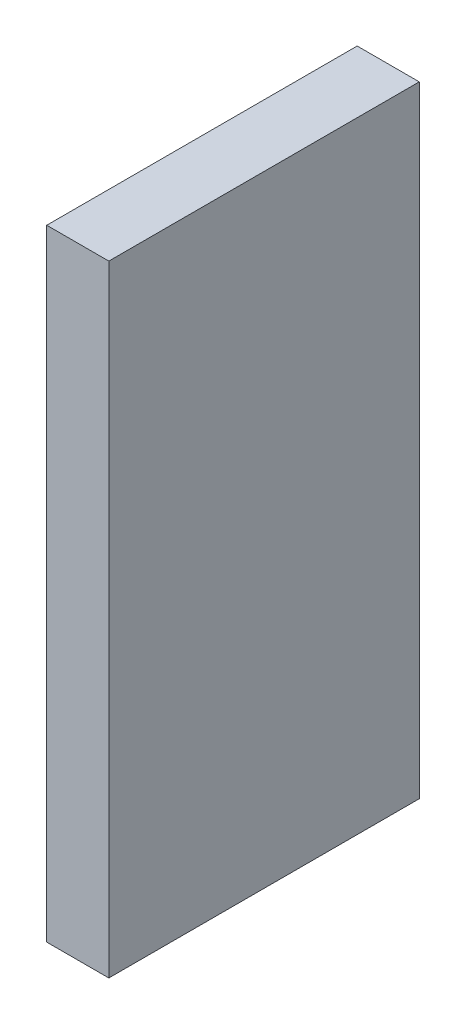
ISO-10303-21;
HEADER;
FILE_DESCRIPTION(('STEP AP214'),'2;1');
FILE_NAME('part.step','',(''),(''),'','','');
FILE_SCHEMA(('AUTOMOTIVE_DESIGN { 1 0 10303 214 1 1 1 1 }'));
ENDSEC;
DATA;
#1=APPLICATION_CONTEXT('core data for automotive mechanical design processes');
#2=APPLICATION_PROTOCOL_DEFINITION('international standard','automotive_design',2000,#1);
#3=PRODUCT_CONTEXT('',#1,'mechanical');
#4=PRODUCT('Part','Part','',(#3));
#5=PRODUCT_RELATED_PRODUCT_CATEGORY('part','',(#4));
#6=PRODUCT_DEFINITION_FORMATION('','',#4);
#7=PRODUCT_DEFINITION_CONTEXT('part definition',#1,'design');
#8=PRODUCT_DEFINITION('design','',#6,#7);
#9=PRODUCT_DEFINITION_SHAPE('','',#8);
#10=(LENGTH_UNIT() NAMED_UNIT(*) SI_UNIT(.MILLI.,.METRE.));
#11=(NAMED_UNIT(*) PLANE_ANGLE_UNIT() SI_UNIT($,.RADIAN.));
#12=(NAMED_UNIT(*) SI_UNIT($,.STERADIAN.) SOLID_ANGLE_UNIT());
#13=UNCERTAINTY_MEASURE_WITH_UNIT(LENGTH_MEASURE(1.E-05),#10,'distance_accuracy_value','');
#14=(GEOMETRIC_REPRESENTATION_CONTEXT(3) GLOBAL_UNCERTAINTY_ASSIGNED_CONTEXT((#13)) GLOBAL_UNIT_ASSIGNED_CONTEXT((#10,
#11,#12)) REPRESENTATION_CONTEXT('',''));
#15=CARTESIAN_POINT('',(0.,0.,0.));
#16=DIRECTION('',(0.,0.,1.));
#17=DIRECTION('',(1.,0.,0.));
#18=AXIS2_PLACEMENT_3D('',#15,#16,#17);
#19=CARTESIAN_POINT('',(12.,60.,-30.));
#20=DIRECTION('',(0.,0.,1.));
#21=DIRECTION('',(0.,-1.,0.));
#22=AXIS2_PLACEMENT_3D('',#19,#20,#21);
#23=PLANE('',#22);
#24=DIRECTION('',(0.,1.,0.));
#25=VECTOR('',#24,1.);
#26=CARTESIAN_POINT('',(0.,60.,-30.));
#27=LINE('',#26,#25);
#28=CARTESIAN_POINT('',(0.,-60.,-30.));
#29=VERTEX_POINT('',#28);
#30=CARTESIAN_POINT('',(0.,60.,-30.));
#31=VERTEX_POINT('',#30);
#32=EDGE_CURVE('E107',#29,#31,#27,.T.);
#33=ORIENTED_EDGE('',*,*,#32,.T.);
#34=DIRECTION('',(-1.,0.,0.));
#35=VECTOR('',#34,1.);
#36=CARTESIAN_POINT('',(12.,60.,-30.));
#37=LINE('',#36,#35);
#38=CARTESIAN_POINT('',(12.,60.,-30.));
#39=VERTEX_POINT('',#38);
#40=EDGE_CURVE('E11',#39,#31,#37,.T.);
#41=ORIENTED_EDGE('',*,*,#40,.F.);
#42=DIRECTION('',(0.,1.,0.));
#43=VECTOR('',#42,1.);
#44=CARTESIAN_POINT('',(12.,60.,-30.));
#45=LINE('',#44,#43);
#46=CARTESIAN_POINT('',(12.,-60.,-30.));
#47=VERTEX_POINT('',#46);
#48=EDGE_CURVE('E91',#47,#39,#45,.T.);
#49=ORIENTED_EDGE('',*,*,#48,.F.);
#50=DIRECTION('',(-1.,0.,0.));
#51=VECTOR('',#50,1.);
#52=CARTESIAN_POINT('',(12.,-60.,-30.));
#53=LINE('',#52,#51);
#54=EDGE_CURVE('E103',#47,#29,#53,.T.);
#55=ORIENTED_EDGE('',*,*,#54,.T.);
#56=EDGE_LOOP('',(#33,#41,#49,#55));
#57=FACE_BOUND('',#56,.T.);
#58=ADVANCED_FACE('F39',(#57),#23,.F.);
#59=CARTESIAN_POINT('',(12.,60.,30.));
#60=DIRECTION('',(0.,-1.,0.));
#61=DIRECTION('',(0.,0.,-1.));
#62=AXIS2_PLACEMENT_3D('',#59,#60,#61);
#63=PLANE('',#62);
#64=DIRECTION('',(0.,0.,1.));
#65=VECTOR('',#64,1.);
#66=CARTESIAN_POINT('',(0.,60.,30.));
#67=LINE('',#66,#65);
#68=CARTESIAN_POINT('',(0.,60.,30.));
#69=VERTEX_POINT('',#68);
#70=EDGE_CURVE('E96',#31,#69,#67,.T.);
#71=ORIENTED_EDGE('',*,*,#70,.T.);
#72=DIRECTION('',(-1.,0.,0.));
#73=VECTOR('',#72,1.);
#74=CARTESIAN_POINT('',(12.,60.,30.));
#75=LINE('',#74,#73);
#76=CARTESIAN_POINT('',(12.,60.,30.));
#77=VERTEX_POINT('',#76);
#78=EDGE_CURVE('E48',#77,#69,#75,.T.);
#79=ORIENTED_EDGE('',*,*,#78,.F.);
#80=DIRECTION('',(0.,0.,1.));
#81=VECTOR('',#80,1.);
#82=CARTESIAN_POINT('',(12.,60.,30.));
#83=LINE('',#82,#81);
#84=EDGE_CURVE('E86',#39,#77,#83,.T.);
#85=ORIENTED_EDGE('',*,*,#84,.F.);
#86=ORIENTED_EDGE('',*,*,#40,.T.);
#87=EDGE_LOOP('',(#71,#79,#85,#86));
#88=FACE_BOUND('',#87,.T.);
#89=ADVANCED_FACE('F95',(#88),#63,.F.);
#90=CARTESIAN_POINT('',(12.,60.,30.));
#91=DIRECTION('',(0.,0.,-1.));
#92=DIRECTION('',(0.,1.,0.));
#93=AXIS2_PLACEMENT_3D('',#90,#91,#92);
#94=PLANE('',#93);
#95=DIRECTION('',(0.,-1.,0.));
#96=VECTOR('',#95,1.);
#97=CARTESIAN_POINT('',(0.,60.,30.));
#98=LINE('',#97,#96);
#99=CARTESIAN_POINT('',(0.,-60.,30.));
#100=VERTEX_POINT('',#99);
#101=EDGE_CURVE('E73',#69,#100,#98,.T.);
#102=ORIENTED_EDGE('',*,*,#101,.T.);
#103=DIRECTION('',(-1.,0.,0.));
#104=VECTOR('',#103,1.);
#105=CARTESIAN_POINT('',(12.,-60.,30.));
#106=LINE('',#105,#104);
#107=CARTESIAN_POINT('',(12.,-60.,30.));
#108=VERTEX_POINT('',#107);
#109=EDGE_CURVE('E98',#108,#100,#106,.T.);
#110=ORIENTED_EDGE('',*,*,#109,.F.);
#111=DIRECTION('',(0.,-1.,0.));
#112=VECTOR('',#111,1.);
#113=CARTESIAN_POINT('',(12.,60.,30.));
#114=LINE('',#113,#112);
#115=EDGE_CURVE('E89',#77,#108,#114,.T.);
#116=ORIENTED_EDGE('',*,*,#115,.F.);
#117=ORIENTED_EDGE('',*,*,#78,.T.);
#118=EDGE_LOOP('',(#102,#110,#116,#117));
#119=FACE_BOUND('',#118,.T.);
#120=ADVANCED_FACE('F99',(#119),#94,.F.);
#121=CARTESIAN_POINT('',(12.,-60.,30.));
#122=DIRECTION('',(0.,1.,0.));
#123=DIRECTION('',(0.,0.,1.));
#124=AXIS2_PLACEMENT_3D('',#121,#122,#123);
#125=PLANE('',#124);
#126=DIRECTION('',(0.,0.,-1.));
#127=VECTOR('',#126,1.);
#128=CARTESIAN_POINT('',(0.,-60.,30.));
#129=LINE('',#128,#127);
#130=EDGE_CURVE('E79',#100,#29,#129,.T.);
#131=ORIENTED_EDGE('',*,*,#130,.T.);
#132=ORIENTED_EDGE('',*,*,#54,.F.);
#133=DIRECTION('',(0.,0.,-1.));
#134=VECTOR('',#133,1.);
#135=CARTESIAN_POINT('',(12.,-60.,30.));
#136=LINE('',#135,#134);
#137=EDGE_CURVE('E56',#108,#47,#136,.T.);
#138=ORIENTED_EDGE('',*,*,#137,.F.);
#139=ORIENTED_EDGE('',*,*,#109,.T.);
#140=EDGE_LOOP('',(#131,#132,#138,#139));
#141=FACE_BOUND('',#140,.T.);
#142=ADVANCED_FACE('F120',(#141),#125,.F.);
#143=CARTESIAN_POINT('',(12.,0.,0.));
#144=DIRECTION('',(1.,0.,0.));
#145=DIRECTION('',(0.,0.,-1.));
#146=AXIS2_PLACEMENT_3D('',#143,#144,#145);
#147=PLANE('',#146);
#148=ORIENTED_EDGE('',*,*,#48,.T.);
#149=ORIENTED_EDGE('',*,*,#84,.T.);
#150=ORIENTED_EDGE('',*,*,#115,.T.);
#151=ORIENTED_EDGE('',*,*,#137,.T.);
#152=EDGE_LOOP('',(#148,#149,#150,#151));
#153=FACE_BOUND('',#152,.T.);
#154=ADVANCED_FACE('F87',(#153),#147,.T.);
#155=CARTESIAN_POINT('',(0.,0.,0.));
#156=DIRECTION('',(1.,0.,0.));
#157=DIRECTION('',(0.,0.,-1.));
#158=AXIS2_PLACEMENT_3D('',#155,#156,#157);
#159=PLANE('',#158);
#160=ORIENTED_EDGE('',*,*,#32,.F.);
#161=ORIENTED_EDGE('',*,*,#130,.F.);
#162=ORIENTED_EDGE('',*,*,#101,.F.);
#163=ORIENTED_EDGE('',*,*,#70,.F.);
#164=EDGE_LOOP('',(#160,#161,#162,#163));
#165=FACE_BOUND('',#164,.T.);
#166=ADVANCED_FACE('F123',(#165),#159,.F.);
#167=CLOSED_SHELL('',(#58,#89,#120,#142,#154,#166));
#168=MANIFOLD_SOLID_BREP('B2',#167);
#169=ADVANCED_BREP_SHAPE_REPRESENTATION('',(#18,#168),#14);
#170=SHAPE_DEFINITION_REPRESENTATION(#9,#169);
ENDSEC;
END-ISO-10303-21;
